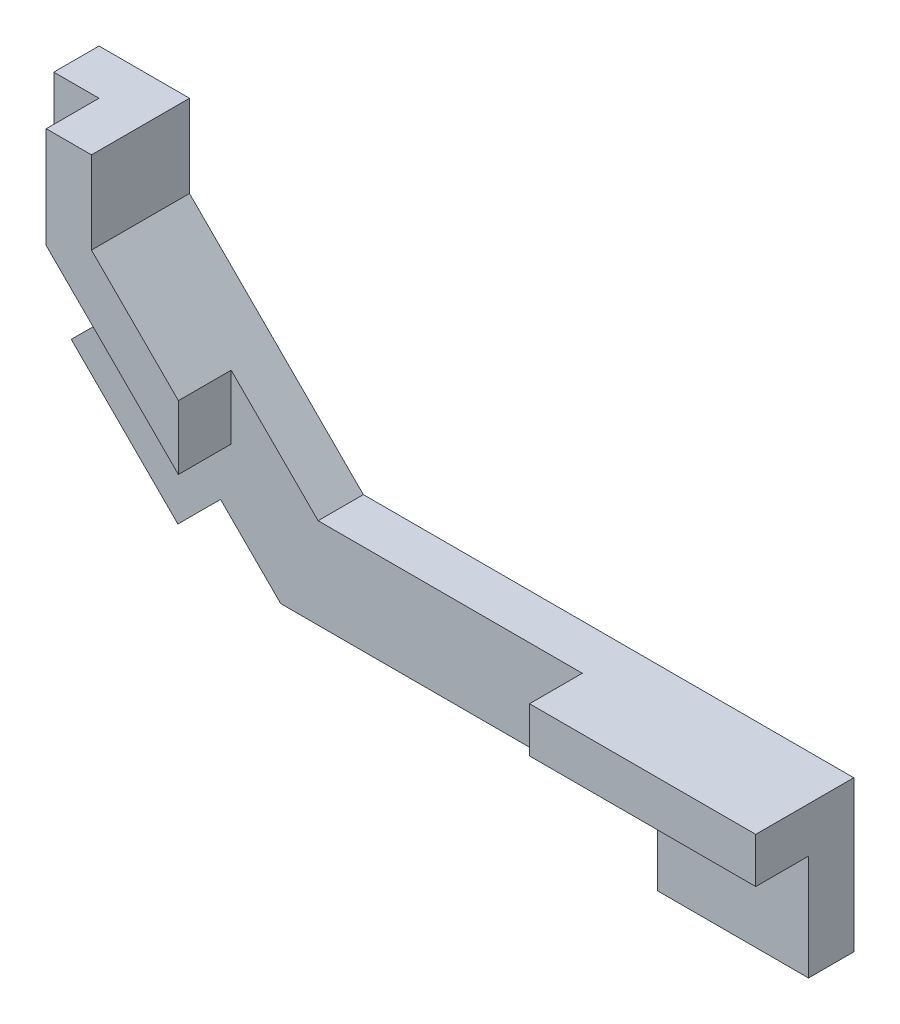
ISO-10303-21;
HEADER;
FILE_DESCRIPTION(('STEP AP214'),'2;1');
FILE_NAME('part.step','',(''),(''),'','','');
FILE_SCHEMA(('AUTOMOTIVE_DESIGN { 1 0 10303 214 1 1 1 1 }'));
ENDSEC;
DATA;
#1=APPLICATION_CONTEXT('core data for automotive mechanical design processes');
#2=APPLICATION_PROTOCOL_DEFINITION('international standard','automotive_design',2000,#1);
#3=PRODUCT_CONTEXT('',#1,'mechanical');
#4=PRODUCT('Part','Part','',(#3));
#5=PRODUCT_RELATED_PRODUCT_CATEGORY('part','',(#4));
#6=PRODUCT_DEFINITION_FORMATION('','',#4);
#7=PRODUCT_DEFINITION_CONTEXT('part definition',#1,'design');
#8=PRODUCT_DEFINITION('design','',#6,#7);
#9=PRODUCT_DEFINITION_SHAPE('','',#8);
#10=(LENGTH_UNIT() NAMED_UNIT(*) SI_UNIT(.MILLI.,.METRE.));
#11=(NAMED_UNIT(*) PLANE_ANGLE_UNIT() SI_UNIT($,.RADIAN.));
#12=(NAMED_UNIT(*) SI_UNIT($,.STERADIAN.) SOLID_ANGLE_UNIT());
#13=UNCERTAINTY_MEASURE_WITH_UNIT(LENGTH_MEASURE(1.E-05),#10,'distance_accuracy_value','');
#14=(GEOMETRIC_REPRESENTATION_CONTEXT(3) GLOBAL_UNCERTAINTY_ASSIGNED_CONTEXT((#13)) GLOBAL_UNIT_ASSIGNED_CONTEXT((#10,
#11,#12)) REPRESENTATION_CONTEXT('',''));
#15=CARTESIAN_POINT('',(0.,0.,0.));
#16=DIRECTION('',(0.,0.,1.));
#17=DIRECTION('',(1.,0.,0.));
#18=AXIS2_PLACEMENT_3D('',#15,#16,#17);
#19=CARTESIAN_POINT('',(-17.5,0.,-30.4149886020059));
#20=DIRECTION('',(-0.707106781186544,-0.707106781186551,0.));
#21=DIRECTION('',(0.707106781186551,-0.707106781186544,0.));
#22=AXIS2_PLACEMENT_3D('',#19,#20,#21);
#23=PLANE('',#22);
#24=DIRECTION('',(0.707106781186551,-0.707106781186544,0.));
#25=VECTOR('',#24,1.);
#26=CARTESIAN_POINT('',(-17.5,0.,1.5));
#27=LINE('',#26,#25);
#28=CARTESIAN_POINT('',(-21.4880822458922,3.9880822458921,1.5));
#29=VERTEX_POINT('',#28);
#30=CARTESIAN_POINT('',(-17.5,0.,1.5));
#31=VERTEX_POINT('',#30);
#32=EDGE_CURVE('E473',#29,#31,#27,.T.);
#33=ORIENTED_EDGE('',*,*,#32,.F.);
#34=DIRECTION('',(0.,0.,1.));
#35=VECTOR('',#34,1.);
#36=CARTESIAN_POINT('',(-21.4880822458922,3.9880822458921,1.5));
#37=LINE('',#36,#35);
#38=CARTESIAN_POINT('',(-21.4880822458922,3.9880822458921,-1.5));
#39=VERTEX_POINT('',#38);
#40=EDGE_CURVE('E535',#39,#29,#37,.T.);
#41=ORIENTED_EDGE('',*,*,#40,.F.);
#42=DIRECTION('',(-0.707106781186551,0.707106781186544,0.));
#43=VECTOR('',#42,1.);
#44=CARTESIAN_POINT('',(-17.5,0.,-1.5));
#45=LINE('',#44,#43);
#46=CARTESIAN_POINT('',(-17.5,0.,-1.5));
#47=VERTEX_POINT('',#46);
#48=EDGE_CURVE('E334',#47,#39,#45,.T.);
#49=ORIENTED_EDGE('',*,*,#48,.F.);
#50=DIRECTION('',(0.,0.,1.));
#51=VECTOR('',#50,1.);
#52=CARTESIAN_POINT('',(-17.5,0.,1.5));
#53=LINE('',#52,#51);
#54=EDGE_CURVE('E463',#47,#31,#53,.T.);
#55=ORIENTED_EDGE('',*,*,#54,.T.);
#56=EDGE_LOOP('',(#33,#41,#49,#55));
#57=FACE_BOUND('',#56,.T.);
#58=ADVANCED_FACE('F164',(#57),#23,.T.);
#59=CARTESIAN_POINT('',(-28.5591500577577,11.0591500577575,-1.5));
#60=VERTEX_POINT('',#59);
#61=CARTESIAN_POINT('',(-32.5472323036498,15.0472323036496,-1.49999999999999));
#62=VERTEX_POINT('',#61);
#63=EDGE_CURVE('E460',#60,#62,#45,.T.);
#64=ORIENTED_EDGE('',*,*,#63,.F.);
#65=DIRECTION('',(0.,0.,-1.));
#66=VECTOR('',#65,1.);
#67=CARTESIAN_POINT('',(-28.5591500577577,11.0591500577575,1.5));
#68=LINE('',#67,#66);
#69=CARTESIAN_POINT('',(-28.5591500577577,11.0591500577575,1.5));
#70=VERTEX_POINT('',#69);
#71=EDGE_CURVE('E329',#70,#60,#68,.T.);
#72=ORIENTED_EDGE('',*,*,#71,.F.);
#73=CARTESIAN_POINT('',(-32.5472323036498,15.0472323036496,1.5));
#74=VERTEX_POINT('',#73);
#75=EDGE_CURVE('E474',#74,#70,#27,.T.);
#76=ORIENTED_EDGE('',*,*,#75,.F.);
#77=DIRECTION('',(0.,0.,1.));
#78=VECTOR('',#77,1.);
#79=CARTESIAN_POINT('',(-32.5472323036498,15.0472323036496,-30.4149886020059));
#80=LINE('',#79,#78);
#81=EDGE_CURVE('E451',#62,#74,#80,.T.);
#82=ORIENTED_EDGE('',*,*,#81,.F.);
#83=EDGE_LOOP('',(#64,#72,#76,#82));
#84=FACE_BOUND('',#83,.T.);
#85=ADVANCED_FACE('F554',(#84),#23,.T.);
#86=CARTESIAN_POINT('',(0.,0.,0.));
#87=DIRECTION('',(0.,1.,0.));
#88=DIRECTION('',(0.,0.,1.));
#89=AXIS2_PLACEMENT_3D('',#86,#87,#88);
#90=PLANE('',#89);
#91=DIRECTION('',(0.,0.,-1.));
#92=VECTOR('',#91,1.);
#93=CARTESIAN_POINT('',(7.49999999999999,0.,-1.5));
#94=LINE('',#93,#92);
#95=CARTESIAN_POINT('',(7.49999999999999,0.,1.5));
#96=VERTEX_POINT('',#95);
#97=CARTESIAN_POINT('',(7.49999999999999,0.,-1.5));
#98=VERTEX_POINT('',#97);
#99=EDGE_CURVE('E188',#96,#98,#94,.T.);
#100=ORIENTED_EDGE('',*,*,#99,.F.);
#101=DIRECTION('',(1.,0.,0.));
#102=VECTOR('',#101,1.);
#103=CARTESIAN_POINT('',(17.5,0.,1.5));
#104=LINE('',#103,#102);
#105=EDGE_CURVE('E507',#31,#96,#104,.T.);
#106=ORIENTED_EDGE('',*,*,#105,.F.);
#107=ORIENTED_EDGE('',*,*,#54,.F.);
#108=DIRECTION('',(-1.,0.,0.));
#109=VECTOR('',#108,1.);
#110=CARTESIAN_POINT('',(17.5,0.,-1.5));
#111=LINE('',#110,#109);
#112=EDGE_CURVE('E498',#98,#47,#111,.T.);
#113=ORIENTED_EDGE('',*,*,#112,.F.);
#114=EDGE_LOOP('',(#100,#106,#107,#113));
#115=FACE_BOUND('',#114,.T.);
#116=ADVANCED_FACE('F532',(#115),#90,.F.);
#117=CARTESIAN_POINT('',(17.5,6.,1.5));
#118=DIRECTION('',(0.,0.,-1.));
#119=DIRECTION('',(-1.,0.,0.));
#120=AXIS2_PLACEMENT_3D('',#117,#118,#119);
#121=PLANE('',#120);
#122=DIRECTION('',(1.,0.,0.));
#123=VECTOR('',#122,1.);
#124=CARTESIAN_POINT('',(17.5,3.,1.5));
#125=LINE('',#124,#123);
#126=CARTESIAN_POINT('',(2.5,3.,1.5));
#127=VERTEX_POINT('',#126);
#128=CARTESIAN_POINT('',(17.5,3.,1.5));
#129=VERTEX_POINT('',#128);
#130=EDGE_CURVE('E394',#127,#129,#125,.T.);
#131=ORIENTED_EDGE('',*,*,#130,.F.);
#132=DIRECTION('',(0.,1.,0.));
#133=VECTOR('',#132,1.);
#134=CARTESIAN_POINT('',(2.5,6.,1.5));
#135=LINE('',#134,#133);
#136=CARTESIAN_POINT('',(2.5,6.,1.5));
#137=VERTEX_POINT('',#136);
#138=EDGE_CURVE('E390',#127,#137,#135,.T.);
#139=ORIENTED_EDGE('',*,*,#138,.T.);
#140=DIRECTION('',(1.,0.,0.));
#141=VECTOR('',#140,1.);
#142=CARTESIAN_POINT('',(17.5,6.,1.5));
#143=LINE('',#142,#141);
#144=CARTESIAN_POINT('',(-15.0200000000001,6.,1.5));
#145=VERTEX_POINT('',#144);
#146=EDGE_CURVE('E493',#145,#137,#143,.T.);
#147=ORIENTED_EDGE('',*,*,#146,.F.);
#148=DIRECTION('',(-0.707106781186551,0.707106781186544,0.));
#149=VECTOR('',#148,1.);
#150=CARTESIAN_POINT('',(-26.5472323036498,17.5272323036496,1.5));
#151=LINE('',#150,#149);
#152=CARTESIAN_POINT('',(-20.783616151825,11.7636161518248,1.5));
#153=VERTEX_POINT('',#152);
#154=EDGE_CURVE('E445',#145,#153,#151,.T.);
#155=ORIENTED_EDGE('',*,*,#154,.T.);
#156=DIRECTION('',(0.,1.,0.));
#157=VECTOR('',#156,1.);
#158=CARTESIAN_POINT('',(-20.7836161518249,6.,1.5));
#159=LINE('',#158,#157);
#160=CARTESIAN_POINT('',(-20.783616151825,7.52097546470556,1.5));
#161=VERTEX_POINT('',#160);
#162=EDGE_CURVE('E425',#161,#153,#159,.T.);
#163=ORIENTED_EDGE('',*,*,#162,.F.);
#164=DIRECTION('',(0.70710678118655,-0.707106781186545,0.));
#165=VECTOR('',#164,1.);
#166=CARTESIAN_POINT('',(-0.881320343559554,-12.3813203435597,1.5));
#167=LINE('',#166,#165);
#168=CARTESIAN_POINT('',(-29.5472323036498,16.2845916165304,1.5));
#169=VERTEX_POINT('',#168);
#170=EDGE_CURVE('E441',#169,#161,#167,.T.);
#171=ORIENTED_EDGE('',*,*,#170,.F.);
#172=DIRECTION('',(0.,-1.,0.));
#173=VECTOR('',#172,1.);
#174=CARTESIAN_POINT('',(-29.5472323036498,6.,1.5));
#175=LINE('',#174,#173);
#176=CARTESIAN_POINT('',(-29.5472323036498,22.9972323036496,1.5));
#177=VERTEX_POINT('',#176);
#178=EDGE_CURVE('E437',#177,#169,#175,.T.);
#179=ORIENTED_EDGE('',*,*,#178,.F.);
#180=DIRECTION('',(-1.,0.,0.));
#181=VECTOR('',#180,1.);
#182=CARTESIAN_POINT('',(-32.5472323036498,22.9972323036496,1.5));
#183=LINE('',#182,#181);
#184=CARTESIAN_POINT('',(-32.5472323036498,22.9972323036496,1.5));
#185=VERTEX_POINT('',#184);
#186=EDGE_CURVE('E466',#177,#185,#183,.T.);
#187=ORIENTED_EDGE('',*,*,#186,.T.);
#188=DIRECTION('',(0.,-1.,0.));
#189=VECTOR('',#188,1.);
#190=CARTESIAN_POINT('',(-32.5472323036498,15.0472323036496,1.5));
#191=LINE('',#190,#189);
#192=EDGE_CURVE('E469',#185,#74,#191,.T.);
#193=ORIENTED_EDGE('',*,*,#192,.T.);
#194=ORIENTED_EDGE('',*,*,#75,.T.);
#195=DIRECTION('',(0.707106781186544,0.707106781186552,0.));
#196=VECTOR('',#195,1.);
#197=CARTESIAN_POINT('',(-31.3875771825039,8.23072293301134,1.5));
#198=LINE('',#197,#196);
#199=CARTESIAN_POINT('',(-31.3875771825039,8.23072293301134,1.5));
#200=VERTEX_POINT('',#199);
#201=EDGE_CURVE('E180',#200,#70,#198,.T.);
#202=ORIENTED_EDGE('',*,*,#201,.F.);
#203=DIRECTION('',(-0.707106781186551,0.707106781186544,0.));
#204=VECTOR('',#203,1.);
#205=CARTESIAN_POINT('',(-24.3165093706383,1.1596551211459,1.5));
#206=LINE('',#205,#204);
#207=CARTESIAN_POINT('',(-24.3165093706383,1.1596551211459,1.5));
#208=VERTEX_POINT('',#207);
#209=EDGE_CURVE('E319',#208,#200,#206,.T.);
#210=ORIENTED_EDGE('',*,*,#209,.F.);
#211=DIRECTION('',(0.707106781186544,0.707106781186552,0.));
#212=VECTOR('',#211,1.);
#213=CARTESIAN_POINT('',(-24.3165093706383,1.1596551211459,1.5));
#214=LINE('',#213,#212);
#215=EDGE_CURVE('E315',#208,#29,#214,.T.);
#216=ORIENTED_EDGE('',*,*,#215,.T.);
#217=ORIENTED_EDGE('',*,*,#32,.T.);
#218=ORIENTED_EDGE('',*,*,#105,.T.);
#219=DIRECTION('',(0.,1.,0.));
#220=VECTOR('',#219,1.);
#221=CARTESIAN_POINT('',(7.49999999999999,-4.,1.5));
#222=LINE('',#221,#220);
#223=CARTESIAN_POINT('',(7.49999999999999,-4.,1.5));
#224=VERTEX_POINT('',#223);
#225=EDGE_CURVE('E361',#224,#96,#222,.T.);
#226=ORIENTED_EDGE('',*,*,#225,.F.);
#227=DIRECTION('',(-1.,0.,0.));
#228=VECTOR('',#227,1.);
#229=CARTESIAN_POINT('',(7.49999999999999,-4.,1.5));
#230=LINE('',#229,#228);
#231=CARTESIAN_POINT('',(17.5,-4.,1.5));
#232=VERTEX_POINT('',#231);
#233=EDGE_CURVE('E347',#232,#224,#230,.T.);
#234=ORIENTED_EDGE('',*,*,#233,.F.);
#235=DIRECTION('',(0.,-1.,0.));
#236=VECTOR('',#235,1.);
#237=CARTESIAN_POINT('',(17.5,6.,1.5));
#238=LINE('',#237,#236);
#239=EDGE_CURVE('E12',#129,#232,#238,.T.);
#240=ORIENTED_EDGE('',*,*,#239,.F.);
#241=EDGE_LOOP('',(#131,#139,#147,#155,#163,#171,#179,#187,#193,#194,#202,#210,#216,#217,#218,
#226,#234,#240));
#242=FACE_BOUND('',#241,.T.);
#243=ADVANCED_FACE('F166',(#242),#121,.F.);
#244=CARTESIAN_POINT('',(17.5,6.,1.5));
#245=DIRECTION('',(-1.,0.,0.));
#246=DIRECTION('',(0.,0.,1.));
#247=AXIS2_PLACEMENT_3D('',#244,#245,#246);
#248=PLANE('',#247);
#249=DIRECTION('',(0.,0.,-1.));
#250=VECTOR('',#249,1.);
#251=CARTESIAN_POINT('',(17.5,6.,1.5));
#252=LINE('',#251,#250);
#253=CARTESIAN_POINT('',(17.5,6.,5.));
#254=VERTEX_POINT('',#253);
#255=CARTESIAN_POINT('',(17.5,6.,-1.5));
#256=VERTEX_POINT('',#255);
#257=EDGE_CURVE('E497',#254,#256,#252,.T.);
#258=ORIENTED_EDGE('',*,*,#257,.F.);
#259=DIRECTION('',(0.,1.,0.));
#260=VECTOR('',#259,1.);
#261=CARTESIAN_POINT('',(17.5,0.,5.));
#262=LINE('',#261,#260);
#263=CARTESIAN_POINT('',(17.5,3.,5.));
#264=VERTEX_POINT('',#263);
#265=EDGE_CURVE('E369',#264,#254,#262,.T.);
#266=ORIENTED_EDGE('',*,*,#265,.F.);
#267=DIRECTION('',(0.,0.,1.));
#268=VECTOR('',#267,1.);
#269=CARTESIAN_POINT('',(17.5,3.,-19.2852605772727));
#270=LINE('',#269,#268);
#271=EDGE_CURVE('E365',#129,#264,#270,.T.);
#272=ORIENTED_EDGE('',*,*,#271,.F.);
#273=ORIENTED_EDGE('',*,*,#239,.T.);
#274=DIRECTION('',(0.,0.,1.));
#275=VECTOR('',#274,1.);
#276=CARTESIAN_POINT('',(17.5,-4.,-1.5));
#277=LINE('',#276,#275);
#278=CARTESIAN_POINT('',(17.5,-4.,-1.5));
#279=VERTEX_POINT('',#278);
#280=EDGE_CURVE('E339',#279,#232,#277,.T.);
#281=ORIENTED_EDGE('',*,*,#280,.F.);
#282=DIRECTION('',(0.,-1.,0.));
#283=VECTOR('',#282,1.);
#284=CARTESIAN_POINT('',(17.5,6.,-1.5));
#285=LINE('',#284,#283);
#286=EDGE_CURVE('E173',#256,#279,#285,.T.);
#287=ORIENTED_EDGE('',*,*,#286,.F.);
#288=EDGE_LOOP('',(#258,#266,#272,#273,#281,#287));
#289=FACE_BOUND('',#288,.T.);
#290=ADVANCED_FACE('F521',(#289),#248,.F.);
#291=CARTESIAN_POINT('',(17.5,6.,-1.5));
#292=DIRECTION('',(0.,0.,1.));
#293=DIRECTION('',(1.,0.,0.));
#294=AXIS2_PLACEMENT_3D('',#291,#292,#293);
#295=PLANE('',#294);
#296=ORIENTED_EDGE('',*,*,#286,.T.);
#297=DIRECTION('',(1.,0.,0.));
#298=VECTOR('',#297,1.);
#299=CARTESIAN_POINT('',(7.49999999999999,-4.,-1.5));
#300=LINE('',#299,#298);
#301=CARTESIAN_POINT('',(7.49999999999999,-4.,-1.5));
#302=VERTEX_POINT('',#301);
#303=EDGE_CURVE('E353',#302,#279,#300,.T.);
#304=ORIENTED_EDGE('',*,*,#303,.F.);
#305=DIRECTION('',(0.,1.,0.));
#306=VECTOR('',#305,1.);
#307=CARTESIAN_POINT('',(7.49999999999999,-4.,-1.5));
#308=LINE('',#307,#306);
#309=EDGE_CURVE('E356',#302,#98,#308,.T.);
#310=ORIENTED_EDGE('',*,*,#309,.T.);
#311=ORIENTED_EDGE('',*,*,#112,.T.);
#312=ORIENTED_EDGE('',*,*,#48,.T.);
#313=DIRECTION('',(0.707106781186544,0.707106781186552,0.));
#314=VECTOR('',#313,1.);
#315=CARTESIAN_POINT('',(-24.3165093706383,1.1596551211459,-1.5));
#316=LINE('',#315,#314);
#317=CARTESIAN_POINT('',(-24.3165093706383,1.1596551211459,-1.5));
#318=VERTEX_POINT('',#317);
#319=EDGE_CURVE('E312',#318,#39,#316,.T.);
#320=ORIENTED_EDGE('',*,*,#319,.F.);
#321=DIRECTION('',(0.707106781186551,-0.707106781186544,0.));
#322=VECTOR('',#321,1.);
#323=CARTESIAN_POINT('',(-24.3165093706383,1.1596551211459,-1.5));
#324=LINE('',#323,#322);
#325=CARTESIAN_POINT('',(-31.3875771825039,8.23072293301134,-1.5));
#326=VERTEX_POINT('',#325);
#327=EDGE_CURVE('E320',#326,#318,#324,.T.);
#328=ORIENTED_EDGE('',*,*,#327,.F.);
#329=DIRECTION('',(0.707106781186544,0.707106781186552,0.));
#330=VECTOR('',#329,1.);
#331=CARTESIAN_POINT('',(-31.3875771825039,8.23072293301134,-1.5));
#332=LINE('',#331,#330);
#333=EDGE_CURVE('E543',#326,#60,#332,.T.);
#334=ORIENTED_EDGE('',*,*,#333,.T.);
#335=ORIENTED_EDGE('',*,*,#63,.T.);
#336=DIRECTION('',(0.,1.,0.));
#337=VECTOR('',#336,1.);
#338=CARTESIAN_POINT('',(-32.5472323036498,15.0472323036496,-1.49999999999999));
#339=LINE('',#338,#337);
#340=CARTESIAN_POINT('',(-32.5472323036498,22.9972323036496,-1.49999999999999));
#341=VERTEX_POINT('',#340);
#342=EDGE_CURVE('E457',#62,#341,#339,.T.);
#343=ORIENTED_EDGE('',*,*,#342,.T.);
#344=DIRECTION('',(1.,0.,0.));
#345=VECTOR('',#344,1.);
#346=CARTESIAN_POINT('',(-32.5472323036498,22.9972323036496,-1.49999999999999));
#347=LINE('',#346,#345);
#348=CARTESIAN_POINT('',(-26.5472323036498,22.9972323036496,-1.5));
#349=VERTEX_POINT('',#348);
#350=EDGE_CURVE('E454',#341,#349,#347,.T.);
#351=ORIENTED_EDGE('',*,*,#350,.T.);
#352=DIRECTION('',(0.,-1.,0.));
#353=VECTOR('',#352,1.);
#354=CARTESIAN_POINT('',(-26.5472323036498,22.9972323036496,-1.5));
#355=LINE('',#354,#353);
#356=CARTESIAN_POINT('',(-26.5472323036498,17.5272323036496,-1.5));
#357=VERTEX_POINT('',#356);
#358=EDGE_CURVE('E450',#349,#357,#355,.T.);
#359=ORIENTED_EDGE('',*,*,#358,.T.);
#360=DIRECTION('',(0.707106781186551,-0.707106781186544,0.));
#361=VECTOR('',#360,1.);
#362=CARTESIAN_POINT('',(-26.5472323036498,17.5272323036496,-1.5));
#363=LINE('',#362,#361);
#364=CARTESIAN_POINT('',(-15.0200000000001,6.,-1.5));
#365=VERTEX_POINT('',#364);
#366=EDGE_CURVE('E446',#357,#365,#363,.T.);
#367=ORIENTED_EDGE('',*,*,#366,.T.);
#368=DIRECTION('',(-1.,0.,0.));
#369=VECTOR('',#368,1.);
#370=CARTESIAN_POINT('',(17.5,6.,-1.5));
#371=LINE('',#370,#369);
#372=EDGE_CURVE('E501',#256,#365,#371,.T.);
#373=ORIENTED_EDGE('',*,*,#372,.F.);
#374=EDGE_LOOP('',(#296,#304,#310,#311,#312,#320,#328,#334,#335,#343,#351,#359,#367,#373));
#375=FACE_BOUND('',#374,.T.);
#376=ADVANCED_FACE('F332',(#375),#295,.F.);
#377=CARTESIAN_POINT('',(0.,6.,0.));
#378=DIRECTION('',(0.,1.,0.));
#379=DIRECTION('',(0.,0.,1.));
#380=AXIS2_PLACEMENT_3D('',#377,#378,#379);
#381=PLANE('',#380);
#382=ORIENTED_EDGE('',*,*,#146,.T.);
#383=DIRECTION('',(0.,0.,1.));
#384=VECTOR('',#383,1.);
#385=CARTESIAN_POINT('',(2.5,6.,-19.2852605772727));
#386=LINE('',#385,#384);
#387=CARTESIAN_POINT('',(2.5,6.,5.));
#388=VERTEX_POINT('',#387);
#389=EDGE_CURVE('E366',#137,#388,#386,.T.);
#390=ORIENTED_EDGE('',*,*,#389,.T.);
#391=DIRECTION('',(-1.,0.,0.));
#392=VECTOR('',#391,1.);
#393=CARTESIAN_POINT('',(0.,6.,5.));
#394=LINE('',#393,#392);
#395=EDGE_CURVE('E386',#254,#388,#394,.T.);
#396=ORIENTED_EDGE('',*,*,#395,.F.);
#397=ORIENTED_EDGE('',*,*,#257,.T.);
#398=ORIENTED_EDGE('',*,*,#372,.T.);
#399=DIRECTION('',(0.,0.,1.));
#400=VECTOR('',#399,1.);
#401=CARTESIAN_POINT('',(-15.0200000000001,6.,-30.4149886020059));
#402=LINE('',#401,#400);
#403=EDGE_CURVE('E478',#365,#145,#402,.T.);
#404=ORIENTED_EDGE('',*,*,#403,.T.);
#405=EDGE_LOOP('',(#382,#390,#396,#397,#398,#404));
#406=FACE_BOUND('',#405,.T.);
#407=ADVANCED_FACE('F590',(#406),#381,.T.);
#408=CARTESIAN_POINT('',(-32.5472323036498,15.0472323036496,-30.4149886020059));
#409=DIRECTION('',(-1.,0.,0.));
#410=DIRECTION('',(0.,-1.,0.));
#411=AXIS2_PLACEMENT_3D('',#408,#409,#410);
#412=PLANE('',#411);
#413=ORIENTED_EDGE('',*,*,#342,.F.);
#414=ORIENTED_EDGE('',*,*,#81,.T.);
#415=ORIENTED_EDGE('',*,*,#192,.F.);
#416=DIRECTION('',(0.,0.,1.));
#417=VECTOR('',#416,1.);
#418=CARTESIAN_POINT('',(-32.5472323036498,22.9972323036496,-30.4149886020059));
#419=LINE('',#418,#417);
#420=EDGE_CURVE('E481',#341,#185,#419,.T.);
#421=ORIENTED_EDGE('',*,*,#420,.F.);
#422=EDGE_LOOP('',(#413,#414,#415,#421));
#423=FACE_BOUND('',#422,.T.);
#424=ADVANCED_FACE('F559',(#423),#412,.T.);
#425=CARTESIAN_POINT('',(-32.5472323036498,22.9972323036496,-30.4149886020059));
#426=DIRECTION('',(0.,1.,0.));
#427=DIRECTION('',(-1.,0.,0.));
#428=AXIS2_PLACEMENT_3D('',#425,#426,#427);
#429=PLANE('',#428);
#430=DIRECTION('',(0.,0.,1.));
#431=VECTOR('',#430,1.);
#432=CARTESIAN_POINT('',(-26.5472323036498,22.9972323036496,-30.4149886020059));
#433=LINE('',#432,#431);
#434=CARTESIAN_POINT('',(-26.5472323036498,22.9972323036496,5.));
#435=VERTEX_POINT('',#434);
#436=EDGE_CURVE('E485',#349,#435,#433,.T.);
#437=ORIENTED_EDGE('',*,*,#436,.F.);
#438=ORIENTED_EDGE('',*,*,#350,.F.);
#439=ORIENTED_EDGE('',*,*,#420,.T.);
#440=ORIENTED_EDGE('',*,*,#186,.F.);
#441=DIRECTION('',(0.,0.,1.));
#442=VECTOR('',#441,1.);
#443=CARTESIAN_POINT('',(-29.5472323036498,22.9972323036496,-19.2852605772727));
#444=LINE('',#443,#442);
#445=CARTESIAN_POINT('',(-29.5472323036498,22.9972323036496,5.));
#446=VERTEX_POINT('',#445);
#447=EDGE_CURVE('E429',#177,#446,#444,.T.);
#448=ORIENTED_EDGE('',*,*,#447,.T.);
#449=DIRECTION('',(-1.,0.,0.));
#450=VECTOR('',#449,1.);
#451=CARTESIAN_POINT('',(0.,22.9972323036496,5.));
#452=LINE('',#451,#450);
#453=EDGE_CURVE('E409',#435,#446,#452,.T.);
#454=ORIENTED_EDGE('',*,*,#453,.F.);
#455=EDGE_LOOP('',(#437,#438,#439,#440,#448,#454));
#456=FACE_BOUND('',#455,.T.);
#457=ADVANCED_FACE('F566',(#456),#429,.T.);
#458=CARTESIAN_POINT('',(-26.5472323036498,22.9972323036496,-30.4149886020059));
#459=DIRECTION('',(1.,0.,0.));
#460=DIRECTION('',(0.,0.,-1.));
#461=AXIS2_PLACEMENT_3D('',#458,#459,#460);
#462=PLANE('',#461);
#463=ORIENTED_EDGE('',*,*,#358,.F.);
#464=ORIENTED_EDGE('',*,*,#436,.T.);
#465=DIRECTION('',(0.,1.,0.));
#466=VECTOR('',#465,1.);
#467=CARTESIAN_POINT('',(-26.5472323036498,0.,5.));
#468=LINE('',#467,#466);
#469=CARTESIAN_POINT('',(-26.5472323036498,17.5272323036496,5.));
#470=VERTEX_POINT('',#469);
#471=EDGE_CURVE('E405',#470,#435,#468,.T.);
#472=ORIENTED_EDGE('',*,*,#471,.F.);
#473=DIRECTION('',(0.,0.,1.));
#474=VECTOR('',#473,1.);
#475=CARTESIAN_POINT('',(-26.5472323036498,17.5272323036496,-30.4149886020059));
#476=LINE('',#475,#474);
#477=EDGE_CURVE('E488',#357,#470,#476,.T.);
#478=ORIENTED_EDGE('',*,*,#477,.F.);
#479=EDGE_LOOP('',(#463,#464,#472,#478));
#480=FACE_BOUND('',#479,.T.);
#481=ADVANCED_FACE('F572',(#480),#462,.T.);
#482=CARTESIAN_POINT('',(-26.5472323036498,17.5272323036496,-30.4149886020059));
#483=DIRECTION('',(0.707106781186543,0.707106781186551,0.));
#484=DIRECTION('',(-0.707106781186551,0.707106781186544,0.));
#485=AXIS2_PLACEMENT_3D('',#482,#483,#484);
#486=PLANE('',#485);
#487=ORIENTED_EDGE('',*,*,#477,.T.);
#488=DIRECTION('',(-0.707106781186551,0.707106781186544,0.));
#489=VECTOR('',#488,1.);
#490=CARTESIAN_POINT('',(-4.50999999999995,-4.51,5.));
#491=LINE('',#490,#489);
#492=CARTESIAN_POINT('',(-20.7836161518249,11.7636161518248,5.));
#493=VERTEX_POINT('',#492);
#494=EDGE_CURVE('E401',#493,#470,#491,.T.);
#495=ORIENTED_EDGE('',*,*,#494,.F.);
#496=DIRECTION('',(0.,0.,1.));
#497=VECTOR('',#496,1.);
#498=CARTESIAN_POINT('',(-20.7836161518249,11.7636161518248,-19.2852605772727));
#499=LINE('',#498,#497);
#500=EDGE_CURVE('E421',#153,#493,#499,.T.);
#501=ORIENTED_EDGE('',*,*,#500,.F.);
#502=ORIENTED_EDGE('',*,*,#154,.F.);
#503=ORIENTED_EDGE('',*,*,#403,.F.);
#504=ORIENTED_EDGE('',*,*,#366,.F.);
#505=EDGE_LOOP('',(#487,#495,#501,#502,#503,#504));
#506=FACE_BOUND('',#505,.T.);
#507=ADVANCED_FACE('F576',(#506),#486,.T.);
#508=CARTESIAN_POINT('',(-6.63132034355962,-6.63132034355967,-19.2852605772727));
#509=DIRECTION('',(0.707106781186545,0.70710678118655,0.));
#510=DIRECTION('',(-0.70710678118655,0.707106781186545,0.));
#511=AXIS2_PLACEMENT_3D('',#508,#509,#510);
#512=PLANE('',#511);
#513=DIRECTION('',(0.,0.,1.));
#514=VECTOR('',#513,1.);
#515=CARTESIAN_POINT('',(-29.5472323036498,16.2845916165304,-19.2852605772727));
#516=LINE('',#515,#514);
#517=CARTESIAN_POINT('',(-29.5472323036498,16.2845916165304,5.));
#518=VERTEX_POINT('',#517);
#519=EDGE_CURVE('E426',#169,#518,#516,.T.);
#520=ORIENTED_EDGE('',*,*,#519,.F.);
#521=ORIENTED_EDGE('',*,*,#170,.T.);
#522=DIRECTION('',(0.,0.,1.));
#523=VECTOR('',#522,1.);
#524=CARTESIAN_POINT('',(-20.7836161518249,7.52097546470556,-19.2852605772727));
#525=LINE('',#524,#523);
#526=CARTESIAN_POINT('',(-20.7836161518249,7.52097546470556,5.));
#527=VERTEX_POINT('',#526);
#528=EDGE_CURVE('E422',#161,#527,#525,.T.);
#529=ORIENTED_EDGE('',*,*,#528,.T.);
#530=DIRECTION('',(-0.70710678118655,0.707106781186545,0.));
#531=VECTOR('',#530,1.);
#532=CARTESIAN_POINT('',(-6.63132034355962,-6.63132034355967,5.));
#533=LINE('',#532,#531);
#534=EDGE_CURVE('E417',#527,#518,#533,.T.);
#535=ORIENTED_EDGE('',*,*,#534,.T.);
#536=EDGE_LOOP('',(#520,#521,#529,#535));
#537=FACE_BOUND('',#536,.T.);
#538=ADVANCED_FACE('F626',(#537),#512,.F.);
#539=CARTESIAN_POINT('',(-29.5472323036498,0.,-19.2852605772727));
#540=DIRECTION('',(1.,0.,0.));
#541=DIRECTION('',(0.,0.,-1.));
#542=AXIS2_PLACEMENT_3D('',#539,#540,#541);
#543=PLANE('',#542);
#544=ORIENTED_EDGE('',*,*,#447,.F.);
#545=ORIENTED_EDGE('',*,*,#178,.T.);
#546=ORIENTED_EDGE('',*,*,#519,.T.);
#547=DIRECTION('',(0.,1.,0.));
#548=VECTOR('',#547,1.);
#549=CARTESIAN_POINT('',(-29.5472323036498,0.,5.));
#550=LINE('',#549,#548);
#551=EDGE_CURVE('E413',#518,#446,#550,.T.);
#552=ORIENTED_EDGE('',*,*,#551,.T.);
#553=EDGE_LOOP('',(#544,#545,#546,#552));
#554=FACE_BOUND('',#553,.T.);
#555=ADVANCED_FACE('F760',(#554),#543,.F.);
#556=CARTESIAN_POINT('',(-20.7836161518249,0.,-19.2852605772727));
#557=DIRECTION('',(-1.,0.,0.));
#558=DIRECTION('',(0.,0.,1.));
#559=AXIS2_PLACEMENT_3D('',#556,#557,#558);
#560=PLANE('',#559);
#561=ORIENTED_EDGE('',*,*,#528,.F.);
#562=ORIENTED_EDGE('',*,*,#162,.T.);
#563=ORIENTED_EDGE('',*,*,#500,.T.);
#564=DIRECTION('',(0.,-1.,0.));
#565=VECTOR('',#564,1.);
#566=CARTESIAN_POINT('',(-20.7836161518249,0.,5.));
#567=LINE('',#566,#565);
#568=EDGE_CURVE('E397',#493,#527,#567,.T.);
#569=ORIENTED_EDGE('',*,*,#568,.T.);
#570=EDGE_LOOP('',(#561,#562,#563,#569));
#571=FACE_BOUND('',#570,.T.);
#572=ADVANCED_FACE('F586',(#571),#560,.F.);
#573=CARTESIAN_POINT('',(0.,0.,5.));
#574=DIRECTION('',(0.,0.,1.));
#575=DIRECTION('',(1.,0.,0.));
#576=AXIS2_PLACEMENT_3D('',#573,#574,#575);
#577=PLANE('',#576);
#578=ORIENTED_EDGE('',*,*,#568,.F.);
#579=ORIENTED_EDGE('',*,*,#494,.T.);
#580=ORIENTED_EDGE('',*,*,#471,.T.);
#581=ORIENTED_EDGE('',*,*,#453,.T.);
#582=ORIENTED_EDGE('',*,*,#551,.F.);
#583=ORIENTED_EDGE('',*,*,#534,.F.);
#584=EDGE_LOOP('',(#578,#579,#580,#581,#582,#583));
#585=FACE_BOUND('',#584,.T.);
#586=ADVANCED_FACE('F581',(#585),#577,.T.);
#587=CARTESIAN_POINT('',(0.,3.,-19.2852605772727));
#588=DIRECTION('',(0.,1.,0.));
#589=DIRECTION('',(-1.,0.,0.));
#590=AXIS2_PLACEMENT_3D('',#587,#588,#589);
#591=PLANE('',#590);
#592=DIRECTION('',(0.,0.,1.));
#593=VECTOR('',#592,1.);
#594=CARTESIAN_POINT('',(2.5,3.,-19.2852605772727));
#595=LINE('',#594,#593);
#596=CARTESIAN_POINT('',(2.5,3.,5.));
#597=VERTEX_POINT('',#596);
#598=EDGE_CURVE('E370',#127,#597,#595,.T.);
#599=ORIENTED_EDGE('',*,*,#598,.F.);
#600=ORIENTED_EDGE('',*,*,#130,.T.);
#601=ORIENTED_EDGE('',*,*,#271,.T.);
#602=DIRECTION('',(-1.,0.,0.));
#603=VECTOR('',#602,1.);
#604=CARTESIAN_POINT('',(0.,3.,5.));
#605=LINE('',#604,#603);
#606=EDGE_CURVE('E378',#264,#597,#605,.T.);
#607=ORIENTED_EDGE('',*,*,#606,.T.);
#608=EDGE_LOOP('',(#599,#600,#601,#607));
#609=FACE_BOUND('',#608,.T.);
#610=ADVANCED_FACE('F598',(#609),#591,.F.);
#611=CARTESIAN_POINT('',(2.5,0.,-19.2852605772727));
#612=DIRECTION('',(-1.,0.,0.));
#613=DIRECTION('',(0.,-1.,0.));
#614=AXIS2_PLACEMENT_3D('',#611,#612,#613);
#615=PLANE('',#614);
#616=ORIENTED_EDGE('',*,*,#138,.F.);
#617=ORIENTED_EDGE('',*,*,#598,.T.);
#618=DIRECTION('',(0.,-1.,0.));
#619=VECTOR('',#618,1.);
#620=CARTESIAN_POINT('',(2.5,0.,5.));
#621=LINE('',#620,#619);
#622=EDGE_CURVE('E382',#388,#597,#621,.T.);
#623=ORIENTED_EDGE('',*,*,#622,.F.);
#624=ORIENTED_EDGE('',*,*,#389,.F.);
#625=EDGE_LOOP('',(#616,#617,#623,#624));
#626=FACE_BOUND('',#625,.T.);
#627=ADVANCED_FACE('F600',(#626),#615,.T.);
#628=CARTESIAN_POINT('',(0.,0.,5.));
#629=DIRECTION('',(0.,0.,1.));
#630=DIRECTION('',(1.,0.,0.));
#631=AXIS2_PLACEMENT_3D('',#628,#629,#630);
#632=PLANE('',#631);
#633=ORIENTED_EDGE('',*,*,#395,.T.);
#634=ORIENTED_EDGE('',*,*,#622,.T.);
#635=ORIENTED_EDGE('',*,*,#606,.F.);
#636=ORIENTED_EDGE('',*,*,#265,.T.);
#637=EDGE_LOOP('',(#633,#634,#635,#636));
#638=FACE_BOUND('',#637,.T.);
#639=ADVANCED_FACE('F595',(#638),#632,.T.);
#640=CARTESIAN_POINT('',(7.49999999999999,-4.,-1.5));
#641=DIRECTION('',(1.,0.,0.));
#642=DIRECTION('',(0.,0.,-1.));
#643=AXIS2_PLACEMENT_3D('',#640,#641,#642);
#644=PLANE('',#643);
#645=ORIENTED_EDGE('',*,*,#99,.T.);
#646=ORIENTED_EDGE('',*,*,#309,.F.);
#647=DIRECTION('',(0.,0.,-1.));
#648=VECTOR('',#647,1.);
#649=CARTESIAN_POINT('',(7.49999999999999,-4.,-1.5));
#650=LINE('',#649,#648);
#651=EDGE_CURVE('E350',#224,#302,#650,.T.);
#652=ORIENTED_EDGE('',*,*,#651,.F.);
#653=ORIENTED_EDGE('',*,*,#225,.T.);
#654=EDGE_LOOP('',(#645,#646,#652,#653));
#655=FACE_BOUND('',#654,.T.);
#656=ADVANCED_FACE('F530',(#655),#644,.F.);
#657=CARTESIAN_POINT('',(0.,-4.,0.));
#658=DIRECTION('',(0.,1.,0.));
#659=DIRECTION('',(0.,0.,1.));
#660=AXIS2_PLACEMENT_3D('',#657,#658,#659);
#661=PLANE('',#660);
#662=ORIENTED_EDGE('',*,*,#280,.T.);
#663=ORIENTED_EDGE('',*,*,#233,.T.);
#664=ORIENTED_EDGE('',*,*,#651,.T.);
#665=ORIENTED_EDGE('',*,*,#303,.T.);
#666=EDGE_LOOP('',(#662,#663,#664,#665));
#667=FACE_BOUND('',#666,.T.);
#668=ADVANCED_FACE('F518',(#667),#661,.F.);
#669=CARTESIAN_POINT('',(-24.3165093706383,1.1596551211459,1.5));
#670=DIRECTION('',(-0.707106781186552,0.707106781186544,0.));
#671=DIRECTION('',(-0.707106781186544,-0.707106781186552,0.));
#672=AXIS2_PLACEMENT_3D('',#669,#670,#671);
#673=PLANE('',#672);
#674=ORIENTED_EDGE('',*,*,#40,.T.);
#675=ORIENTED_EDGE('',*,*,#215,.F.);
#676=DIRECTION('',(0.,0.,1.));
#677=VECTOR('',#676,1.);
#678=CARTESIAN_POINT('',(-24.3165093706383,1.1596551211459,1.5));
#679=LINE('',#678,#677);
#680=EDGE_CURVE('E308',#318,#208,#679,.T.);
#681=ORIENTED_EDGE('',*,*,#680,.F.);
#682=ORIENTED_EDGE('',*,*,#319,.T.);
#683=EDGE_LOOP('',(#674,#675,#681,#682));
#684=FACE_BOUND('',#683,.T.);
#685=ADVANCED_FACE('F310',(#684),#673,.F.);
#686=CARTESIAN_POINT('',(-31.3875771825039,8.23072293301134,1.5));
#687=DIRECTION('',(0.707106781186552,-0.707106781186544,0.));
#688=DIRECTION('',(0.707106781186544,0.707106781186552,0.));
#689=AXIS2_PLACEMENT_3D('',#686,#687,#688);
#690=PLANE('',#689);
#691=ORIENTED_EDGE('',*,*,#71,.T.);
#692=ORIENTED_EDGE('',*,*,#333,.F.);
#693=DIRECTION('',(0.,0.,-1.));
#694=VECTOR('',#693,1.);
#695=CARTESIAN_POINT('',(-31.3875771825039,8.23072293301134,1.5));
#696=LINE('',#695,#694);
#697=EDGE_CURVE('E324',#200,#326,#696,.T.);
#698=ORIENTED_EDGE('',*,*,#697,.F.);
#699=ORIENTED_EDGE('',*,*,#201,.T.);
#700=EDGE_LOOP('',(#691,#692,#698,#699));
#701=FACE_BOUND('',#700,.T.);
#702=ADVANCED_FACE('F549',(#701),#690,.F.);
#703=CARTESIAN_POINT('',(-11.5784271247461,-11.5784271247462,0.));
#704=DIRECTION('',(-0.707106781186544,-0.707106781186551,0.));
#705=DIRECTION('',(0.707106781186551,-0.707106781186544,0.));
#706=AXIS2_PLACEMENT_3D('',#703,#704,#705);
#707=PLANE('',#706);
#708=ORIENTED_EDGE('',*,*,#327,.T.);
#709=ORIENTED_EDGE('',*,*,#680,.T.);
#710=ORIENTED_EDGE('',*,*,#209,.T.);
#711=ORIENTED_EDGE('',*,*,#697,.T.);
#712=EDGE_LOOP('',(#708,#709,#710,#711));
#713=FACE_BOUND('',#712,.T.);
#714=ADVANCED_FACE('F323',(#713),#707,.T.);
#715=CLOSED_SHELL('',(#58,#85,#116,#243,#290,#376,#407,#424,#457,#481,#507,#538,#555,#572,#586,
#610,#627,#639,#656,#668,#685,#702,#714));
#716=MANIFOLD_SOLID_BREP('B2',#715);
#717=ADVANCED_BREP_SHAPE_REPRESENTATION('',(#18,#716),#14);
#718=SHAPE_DEFINITION_REPRESENTATION(#9,#717);
ENDSEC;
END-ISO-10303-21;
